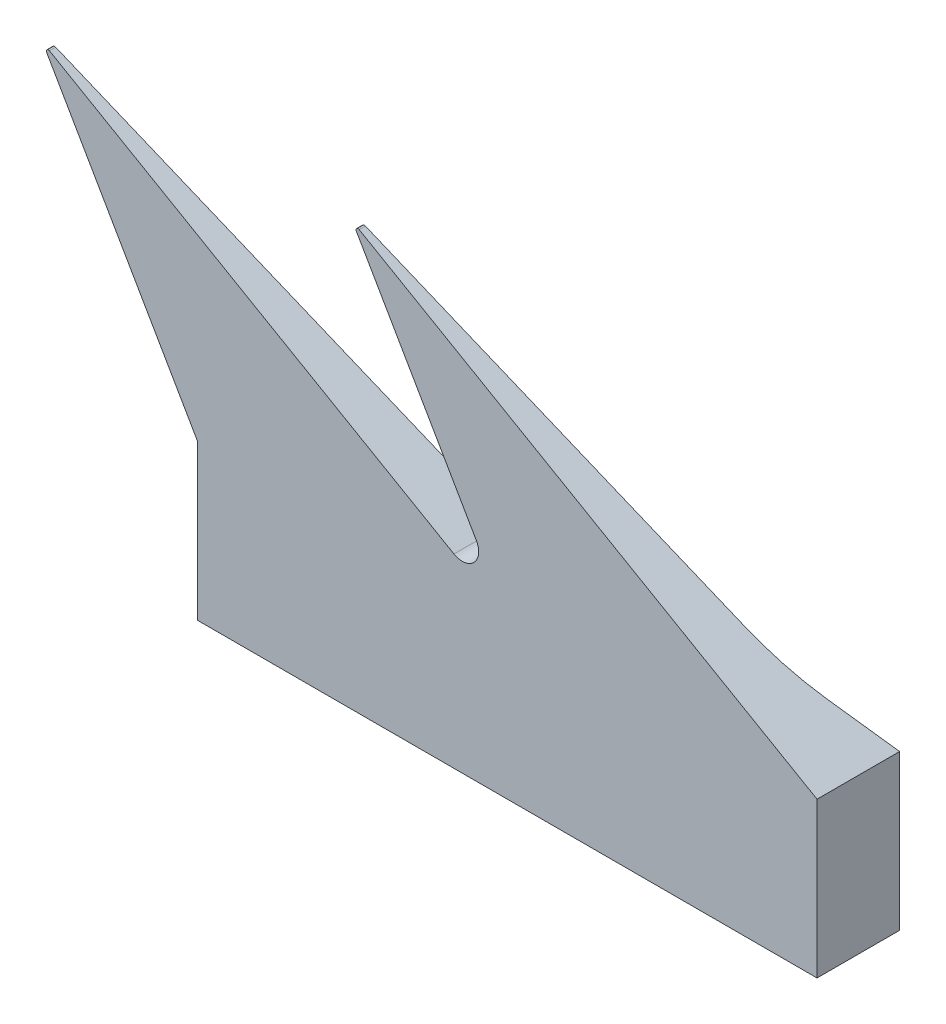
ISO-10303-21;
HEADER;
FILE_DESCRIPTION(('STEP AP214'),'2;1');
FILE_NAME('part.step','',(''),(''),'','','');
FILE_SCHEMA(('AUTOMOTIVE_DESIGN { 1 0 10303 214 1 1 1 1 }'));
ENDSEC;
DATA;
#1=APPLICATION_CONTEXT('core data for automotive mechanical design processes');
#2=APPLICATION_PROTOCOL_DEFINITION('international standard','automotive_design',2000,#1);
#3=PRODUCT_CONTEXT('',#1,'mechanical');
#4=PRODUCT('Part','Part','',(#3));
#5=PRODUCT_RELATED_PRODUCT_CATEGORY('part','',(#4));
#6=PRODUCT_DEFINITION_FORMATION('','',#4);
#7=PRODUCT_DEFINITION_CONTEXT('part definition',#1,'design');
#8=PRODUCT_DEFINITION('design','',#6,#7);
#9=PRODUCT_DEFINITION_SHAPE('','',#8);
#10=(LENGTH_UNIT() NAMED_UNIT(*) SI_UNIT(.MILLI.,.METRE.));
#11=(NAMED_UNIT(*) PLANE_ANGLE_UNIT() SI_UNIT($,.RADIAN.));
#12=(NAMED_UNIT(*) SI_UNIT($,.STERADIAN.) SOLID_ANGLE_UNIT());
#13=UNCERTAINTY_MEASURE_WITH_UNIT(LENGTH_MEASURE(1.E-05),#10,'distance_accuracy_value','');
#14=(GEOMETRIC_REPRESENTATION_CONTEXT(3) GLOBAL_UNCERTAINTY_ASSIGNED_CONTEXT((#13)) GLOBAL_UNIT_ASSIGNED_CONTEXT((#10,
#11,#12)) REPRESENTATION_CONTEXT('',''));
#15=CARTESIAN_POINT('',(0.,0.,0.));
#16=DIRECTION('',(0.,0.,1.));
#17=DIRECTION('',(1.,0.,0.));
#18=AXIS2_PLACEMENT_3D('',#15,#16,#17);
#19=CARTESIAN_POINT('',(1.5,0.,0.4));
#20=DIRECTION('',(1.,0.,0.));
#21=DIRECTION('',(0.,1.,0.));
#22=AXIS2_PLACEMENT_3D('',#19,#20,#21);
#23=PLANE('',#22);
#24=DIRECTION('',(0.,-1.,0.));
#25=VECTOR('',#24,1.);
#26=CARTESIAN_POINT('',(1.5,0.,0.));
#27=LINE('',#26,#25);
#28=CARTESIAN_POINT('',(1.5,0.0240896666818581,0.));
#29=VERTEX_POINT('',#28);
#30=CARTESIAN_POINT('',(1.49999999999998,-0.725910333317876,0.));
#31=VERTEX_POINT('',#30);
#32=EDGE_CURVE('E128',#29,#31,#27,.T.);
#33=ORIENTED_EDGE('',*,*,#32,.F.);
#34=DIRECTION('',(0.,0.,-1.));
#35=VECTOR('',#34,1.);
#36=CARTESIAN_POINT('',(1.5,0.0240896666818581,0.4));
#37=LINE('',#36,#35);
#38=CARTESIAN_POINT('',(1.5,0.0240896666818581,0.4));
#39=VERTEX_POINT('',#38);
#40=EDGE_CURVE('E76',#39,#29,#37,.T.);
#41=ORIENTED_EDGE('',*,*,#40,.F.);
#42=DIRECTION('',(0.,-1.,0.));
#43=VECTOR('',#42,1.);
#44=CARTESIAN_POINT('',(1.5,0.,0.4));
#45=LINE('',#44,#43);
#46=CARTESIAN_POINT('',(1.49999999999998,-0.725910333317876,0.4));
#47=VERTEX_POINT('',#46);
#48=EDGE_CURVE('E135',#39,#47,#45,.T.);
#49=ORIENTED_EDGE('',*,*,#48,.T.);
#50=DIRECTION('',(0.,0.,-1.));
#51=VECTOR('',#50,1.);
#52=CARTESIAN_POINT('',(1.49999999999998,-0.725910333317876,0.4));
#53=LINE('',#52,#51);
#54=EDGE_CURVE('E70',#47,#31,#53,.T.);
#55=ORIENTED_EDGE('',*,*,#54,.T.);
#56=EDGE_LOOP('',(#33,#41,#49,#55));
#57=FACE_BOUND('',#56,.T.);
#58=ADVANCED_FACE('F32',(#57),#23,.T.);
#59=CARTESIAN_POINT('',(0.385431131657719,0.667586302849791,0.4));
#60=DIRECTION('',(-0.500000000000083,-0.866025403784391,0.));
#61=DIRECTION('',(0.866025403784391,-0.500000000000083,0.));
#62=AXIS2_PLACEMENT_3D('',#59,#60,#61);
#63=PLANE('',#62);
#64=ORIENTED_EDGE('',*,*,#40,.T.);
#65=DIRECTION('',(-0.818098303736618,0.472329275886017,0.328055209628287));
#66=VECTOR('',#65,1.);
#67=CARTESIAN_POINT('',(0.398028714891227,0.660313084778785,0.441887508248759));
#68=LINE('',#67,#66);
#69=CARTESIAN_POINT('',(1.24899413568054,0.169007970014901,0.100652673475971));
#70=VERTEX_POINT('',#69);
#71=EDGE_CURVE('E177',#29,#70,#68,.T.);
#72=ORIENTED_EDGE('',*,*,#71,.T.);
#73=CARTESIAN_POINT('',(0.754967328739854,0.454234479989063,-0.310012443143357));
#74=DIRECTION('',(-0.500000000000083,-0.866025403784391,0.));
#75=DIRECTION('',(0.866025403784391,-0.500000000000083,0.));
#76=AXIS2_PLACEMENT_3D('',#73,#74,#75);
#77=ELLIPSE('',#76,0.999999999999878,0.5);
#78=CARTESIAN_POINT('',(0.92481566776194,0.356172495733229,0.180277111348485));
#79=VERTEX_POINT('',#78);
#80=EDGE_CURVE('E131',#70,#79,#77,.T.);
#81=ORIENTED_EDGE('',*,*,#80,.T.);
#82=DIRECTION('',(-0.861727130004754,0.497518390476358,0.0995078115103677));
#83=VECTOR('',#82,1.);
#84=CARTESIAN_POINT('',(0.371931086035538,0.675380557823831,0.244121375767914));
#85=LINE('',#84,#83);
#86=CARTESIAN_POINT('',(-0.717679491924285,1.30446751832094,0.369943994362655));
#87=VERTEX_POINT('',#86);
#88=EDGE_CURVE('E191',#79,#87,#85,.T.);
#89=ORIENTED_EDGE('',*,*,#88,.T.);
#90=DIRECTION('',(0.,0.,-1.));
#91=VECTOR('',#90,1.);
#92=CARTESIAN_POINT('',(-0.717679491924285,1.30446751832094,0.4));
#93=LINE('',#92,#91);
#94=CARTESIAN_POINT('',(-0.717679491924285,1.30446751832094,0.4));
#95=VERTEX_POINT('',#94);
#96=EDGE_CURVE('E151',#95,#87,#93,.T.);
#97=ORIENTED_EDGE('',*,*,#96,.F.);
#98=DIRECTION('',(-0.866025403784391,0.500000000000083,0.));
#99=VECTOR('',#98,1.);
#100=CARTESIAN_POINT('',(0.385431131657719,0.667586302849791,0.4));
#101=LINE('',#100,#99);
#102=EDGE_CURVE('E265',#39,#95,#101,.T.);
#103=ORIENTED_EDGE('',*,*,#102,.F.);
#104=EDGE_LOOP('',(#64,#72,#81,#89,#97,#103));
#105=FACE_BOUND('',#104,.T.);
#106=ADVANCED_FACE('F253',(#105),#63,.F.);
#107=CARTESIAN_POINT('',(-0.722679491924286,1.29580726428309,0.4));
#108=DIRECTION('',(0.,0.,-1.));
#109=DIRECTION('',(-1.,0.,0.));
#110=AXIS2_PLACEMENT_3D('',#107,#108,#109);
#111=CYLINDRICAL_SURFACE('',#110,0.00999999999999989);
#112=ORIENTED_EDGE('',*,*,#96,.T.);
#113=CARTESIAN_POINT('',(-0.722679491924286,1.29580726428309,0.368211871605134));
#114=DIRECTION('',(0.,-0.19612396851166,0.980579108983685));
#115=DIRECTION('',(0.,-0.980579108983685,-0.19612396851166));
#116=AXIS2_PLACEMENT_3D('',#113,#114,#115);
#117=ELLIPSE('',#116,0.0101980553209667,0.00999999999999989);
#118=CARTESIAN_POINT('',(-0.73133974596213,1.29080726428309,0.367211830064809));
#119=VERTEX_POINT('',#118);
#120=EDGE_CURVE('E188',#87,#119,#117,.T.);
#121=ORIENTED_EDGE('',*,*,#120,.T.);
#122=DIRECTION('',(0.,0.,-1.));
#123=VECTOR('',#122,1.);
#124=CARTESIAN_POINT('',(-0.73133974596213,1.29080726428309,0.4));
#125=LINE('',#124,#123);
#126=CARTESIAN_POINT('',(-0.73133974596213,1.29080726428309,0.4));
#127=VERTEX_POINT('',#126);
#128=EDGE_CURVE('E148',#127,#119,#125,.T.);
#129=ORIENTED_EDGE('',*,*,#128,.F.);
#130=CARTESIAN_POINT('',(-0.722679491924286,1.29580726428309,0.4));
#131=DIRECTION('',(0.,0.,1.));
#132=DIRECTION('',(1.,0.,0.));
#133=AXIS2_PLACEMENT_3D('',#130,#131,#132);
#134=CIRCLE('',#133,0.00999999999999989);
#135=EDGE_CURVE('E267',#95,#127,#134,.T.);
#136=ORIENTED_EDGE('',*,*,#135,.F.);
#137=EDGE_LOOP('',(#112,#121,#129,#136));
#138=FACE_BOUND('',#137,.T.);
#139=ADVANCED_FACE('F257',(#138),#111,.T.);
#140=CARTESIAN_POINT('',(0.010431131657716,0.00602241667053465,0.4));
#141=DIRECTION('',(-0.866025403784444,-0.499999999999991,0.));
#142=DIRECTION('',(0.499999999999991,-0.866025403784444,0.));
#143=AXIS2_PLACEMENT_3D('',#140,#141,#142);
#144=PLANE('',#143);
#145=CARTESIAN_POINT('',(-0.248344223753283,0.454234479989088,-0.310012443143357));
#146=DIRECTION('',(-0.866025403784444,-0.499999999999991,0.));
#147=DIRECTION('',(0.499999999999991,-0.866025403784444,0.));
#148=AXIS2_PLACEMENT_3D('',#145,#146,#147);
#149=ELLIPSE('',#148,0.577350269189631,0.5);
#150=CARTESIAN_POINT('',(-0.149282032302751,0.282653731287654,0.15962576513516));
#151=VERTEX_POINT('',#150);
#152=CARTESIAN_POINT('',(-0.19172811074591,0.356172495733256,0.180277111348485));
#153=VERTEX_POINT('',#152);
#154=EDGE_CURVE('E322',#151,#153,#149,.T.);
#155=ORIENTED_EDGE('',*,*,#154,.F.);
#156=DIRECTION('',(0.,0.,-1.));
#157=VECTOR('',#156,1.);
#158=CARTESIAN_POINT('',(-0.149282032302753,0.282653731287652,0.4));
#159=LINE('',#158,#157);
#160=CARTESIAN_POINT('',(-0.149282032302753,0.282653731287652,0.4));
#161=VERTEX_POINT('',#160);
#162=EDGE_CURVE('E145',#161,#151,#159,.T.);
#163=ORIENTED_EDGE('',*,*,#162,.F.);
#164=DIRECTION('',(-0.499999999999991,0.866025403784444,0.));
#165=VECTOR('',#164,1.);
#166=CARTESIAN_POINT('',(0.010431131657716,0.00602241667053465,0.4));
#167=LINE('',#166,#165);
#168=EDGE_CURVE('E273',#161,#127,#167,.T.);
#169=ORIENTED_EDGE('',*,*,#168,.T.);
#170=ORIENTED_EDGE('',*,*,#128,.T.);
#171=DIRECTION('',(-0.492664042989798,0.853319153520647,0.170670920135075));
#172=VECTOR('',#171,1.);
#173=CARTESIAN_POINT('',(-0.0139325297127397,0.0482215160225681,0.118684356929609));
#174=LINE('',#173,#172);
#175=EDGE_CURVE('E179',#153,#119,#174,.T.);
#176=ORIENTED_EDGE('',*,*,#175,.F.);
#177=EDGE_LOOP('',(#155,#163,#169,#170,#176));
#178=FACE_BOUND('',#177,.T.);
#179=ADVANCED_FACE('F249',(#178),#144,.T.);
#180=CARTESIAN_POINT('',(-0.218564064605506,0.242653731287658,0.4));
#181=DIRECTION('',(0.,0.,-1.));
#182=DIRECTION('',(-1.,0.,0.));
#183=AXIS2_PLACEMENT_3D('',#180,#181,#182);
#184=CYLINDRICAL_SURFACE('',#183,0.0799999999999975);
#185=ORIENTED_EDGE('',*,*,#162,.T.);
#186=CARTESIAN_POINT('',(-0.149282032302751,0.282653731287654,0.15962576513516));
#187=CARTESIAN_POINT('',(-0.146884837215577,0.278508743182085,0.158114360044012));
#188=CARTESIAN_POINT('',(-0.144890862550081,0.274189483281882,0.156471407046757));
#189=CARTESIAN_POINT('',(-0.141714361453526,0.265366084277465,0.152967485018155));
#190=CARTESIAN_POINT('',(-0.14052871405971,0.260862728231349,0.151107387365389));
#191=CARTESIAN_POINT('',(-0.13895655981659,0.251807665474613,0.147205079564808));
#192=CARTESIAN_POINT('',(-0.138568763684309,0.247256048735563,0.145163168797352));
#193=CARTESIAN_POINT('',(-0.138559447627537,0.238213658417276,0.140941975359255));
#194=CARTESIAN_POINT('',(-0.138938557814552,0.233722937923936,0.138762581153763));
#195=CARTESIAN_POINT('',(-0.140483293413687,0.224587569033454,0.134161296285397));
#196=CARTESIAN_POINT('',(-0.141703843429069,0.219955293907089,0.131733269558733));
#197=CARTESIAN_POINT('',(-0.144944566699345,0.210984400758366,0.126857687891191));
#198=CARTESIAN_POINT('',(-0.146965589070058,0.206646100316522,0.124410114926487));
#199=CARTESIAN_POINT('',(-0.1519044791991,0.198133211578873,0.119449719349291));
#200=CARTESIAN_POINT('',(-0.154866583942777,0.193981738426713,0.116941028718865));
#201=CARTESIAN_POINT('',(-0.161593441584595,0.186258083332911,0.112135950363567));
#202=CARTESIAN_POINT('',(-0.165356008037091,0.182684369132558,0.109839008267183));
#203=CARTESIAN_POINT('',(-0.172164234306231,0.177396494657992,0.106361129841321));
#204=CARTESIAN_POINT('',(-0.174992788311869,0.175471682874241,0.105072808978771));
#205=CARTESIAN_POINT('',(-0.180942899608193,0.171967046473847,0.102697617838169));
#206=CARTESIAN_POINT('',(-0.184065126535535,0.170388039030234,0.101611225635789));
#207=CARTESIAN_POINT('',(-0.18731823533885,0.169007970014937,0.100652673475971));
#208=B_SPLINE_CURVE_WITH_KNOTS('',3,(#186,#187,#188,#189,#190,#191,#192,#193,#194,#195,#196,
#197,#198,#199,#200,#201,#202,#203,#204,#205,#206,#207),.UNSPECIFIED.,.F.,.F.,(4,2,2,2,2,2,2,2,
2,2,4),(0.,0.0150302016528783,0.0300020377510201,0.0449496611368871,0.0599095708929511,
0.0759519259641572,0.0920113440320434,0.108978523568586,0.125899939351582,0.13683655717655,
0.147798747024277),.UNSPECIFIED.);
#209=CARTESIAN_POINT('',(-0.18731823533885,0.169007970014937,0.100652673475971));
#210=VERTEX_POINT('',#209);
#211=EDGE_CURVE('E206',#151,#210,#208,.T.);
#212=ORIENTED_EDGE('',*,*,#211,.T.);
#213=CARTESIAN_POINT('',(-0.218564064605506,0.242653731287658,0.151803167180258));
#214=DIRECTION('',(0.,-0.570453019948295,0.821330233238659));
#215=DIRECTION('',(0.,-0.821330233238659,-0.570453019948295));
#216=AXIS2_PLACEMENT_3D('',#213,#214,#215);
#217=ELLIPSE('',#216,0.0974029650467662,0.0799999999999975);
#218=CARTESIAN_POINT('',(-0.249809893872165,0.169007970014939,0.100652673475971));
#219=VERTEX_POINT('',#218);
#220=EDGE_CURVE('E182',#210,#219,#217,.F.);
#221=ORIENTED_EDGE('',*,*,#220,.T.);
#222=CARTESIAN_POINT('',(-0.249809893872165,0.169007970014939,0.100652673475971));
#223=CARTESIAN_POINT('',(-0.251327377319013,0.169652934740277,0.101101238177096));
#224=CARTESIAN_POINT('',(-0.252815633271123,0.170339061184294,0.101575245499588));
#225=CARTESIAN_POINT('',(-0.255733690182096,0.171793637507805,0.102574145386014));
#226=CARTESIAN_POINT('',(-0.25716349114111,0.172562087387086,0.103099037949817));
#227=CARTESIAN_POINT('',(-0.258564064605537,0.173371698984833,0.103649373134855));
#228=B_SPLINE_CURVE_WITH_KNOTS('',3,(#222,#223,#224,#225,#226,#227),.UNSPECIFIED.,.F.,.F.,(4,2,
4),(0.,0.00511793160969459,0.0102358632061603),.UNSPECIFIED.);
#229=CARTESIAN_POINT('',(-0.258564064605506,0.173371698984903,0.103649373134862));
#230=VERTEX_POINT('',#229);
#231=EDGE_CURVE('E197',#219,#230,#228,.T.);
#232=ORIENTED_EDGE('',*,*,#231,.T.);
#233=DIRECTION('',(0.,0.,-1.));
#234=VECTOR('',#233,1.);
#235=CARTESIAN_POINT('',(-0.258564064605506,0.173371698984903,0.4));
#236=LINE('',#235,#234);
#237=CARTESIAN_POINT('',(-0.258564064605506,0.173371698984903,0.4));
#238=VERTEX_POINT('',#237);
#239=EDGE_CURVE('E142',#238,#230,#236,.T.);
#240=ORIENTED_EDGE('',*,*,#239,.F.);
#241=CARTESIAN_POINT('',(-0.218564064605506,0.242653731287658,0.4));
#242=DIRECTION('',(0.,0.,1.));
#243=DIRECTION('',(1.,0.,0.));
#244=AXIS2_PLACEMENT_3D('',#241,#242,#243);
#245=CIRCLE('',#244,0.0799999999999975);
#246=EDGE_CURVE('E276',#161,#238,#245,.F.);
#247=ORIENTED_EDGE('',*,*,#246,.F.);
#248=EDGE_LOOP('',(#185,#212,#221,#232,#240,#247));
#249=FACE_BOUND('',#248,.T.);
#250=ADVANCED_FACE('F212',(#249),#184,.F.);
#251=CARTESIAN_POINT('',(0.0104311316577212,0.0180672500116134,0.4));
#252=DIRECTION('',(0.499999999999998,0.86602540378444,0.));
#253=DIRECTION('',(-0.86602540378444,0.499999999999998,0.));
#254=AXIS2_PLACEMENT_3D('',#251,#252,#253);
#255=PLANE('',#254);
#256=CARTESIAN_POINT('',(-0.74503267125987,0.454234479989101,-0.310012443143357));
#257=DIRECTION('',(0.499999999999998,0.86602540378444,0.));
#258=DIRECTION('',(0.86602540378444,-0.499999999999998,0.));
#259=AXIS2_PLACEMENT_3D('',#256,#257,#258);
#260=ELLIPSE('',#259,1.00000000000005,0.5);
#261=CARTESIAN_POINT('',(-0.575184332237743,0.356172495733266,0.180277111348485));
#262=VERTEX_POINT('',#261);
#263=EDGE_CURVE('E194',#262,#230,#260,.T.);
#264=ORIENTED_EDGE('',*,*,#263,.F.);
#265=DIRECTION('',(0.861727130004805,-0.497518390476275,-0.0995078115103509));
#266=VECTOR('',#265,1.);
#267=CARTESIAN_POINT('',(-0.0142084440849831,0.0322929156993819,0.115498504529125));
#268=LINE('',#267,#266);
#269=CARTESIAN_POINT('',(-2.21767949192429,1.30446751832094,0.369943994362649));
#270=VERTEX_POINT('',#269);
#271=EDGE_CURVE('E176',#270,#262,#268,.T.);
#272=ORIENTED_EDGE('',*,*,#271,.F.);
#273=DIRECTION('',(0.,0.,-1.));
#274=VECTOR('',#273,1.);
#275=CARTESIAN_POINT('',(-2.21767949192429,1.30446751832094,0.4));
#276=LINE('',#275,#274);
#277=CARTESIAN_POINT('',(-2.21767949192429,1.30446751832094,0.4));
#278=VERTEX_POINT('',#277);
#279=EDGE_CURVE('E139',#278,#270,#276,.T.);
#280=ORIENTED_EDGE('',*,*,#279,.F.);
#281=DIRECTION('',(0.86602540378444,-0.499999999999998,0.));
#282=VECTOR('',#281,1.);
#283=CARTESIAN_POINT('',(0.0104311316577212,0.0180672500116134,0.4));
#284=LINE('',#283,#282);
#285=EDGE_CURVE('E123',#278,#238,#284,.T.);
#286=ORIENTED_EDGE('',*,*,#285,.T.);
#287=ORIENTED_EDGE('',*,*,#239,.T.);
#288=EDGE_LOOP('',(#264,#272,#280,#286,#287));
#289=FACE_BOUND('',#288,.T.);
#290=ADVANCED_FACE('F243',(#289),#255,.T.);
#291=CARTESIAN_POINT('',(-2.22267949192429,1.2958072642831,0.4));
#292=DIRECTION('',(0.,0.,-1.));
#293=DIRECTION('',(-1.,0.,0.));
#294=AXIS2_PLACEMENT_3D('',#291,#292,#293);
#295=CYLINDRICAL_SURFACE('',#294,0.00999999999999997);
#296=ORIENTED_EDGE('',*,*,#279,.T.);
#297=CARTESIAN_POINT('',(-2.22267949192429,1.2958072642831,0.368211871605127));
#298=DIRECTION('',(0.,-0.19612396851166,0.980579108983685));
#299=DIRECTION('',(0.,-0.980579108983685,-0.19612396851166));
#300=AXIS2_PLACEMENT_3D('',#297,#298,#299);
#301=ELLIPSE('',#300,0.0101980553209668,0.00999999999999997);
#302=CARTESIAN_POINT('',(-2.23133974596213,1.2908072642831,0.367211830064802));
#303=VERTEX_POINT('',#302);
#304=EDGE_CURVE('E167',#270,#303,#301,.T.);
#305=ORIENTED_EDGE('',*,*,#304,.T.);
#306=DIRECTION('',(0.,0.,-1.));
#307=VECTOR('',#306,1.);
#308=CARTESIAN_POINT('',(-2.23133974596213,1.2908072642831,0.4));
#309=LINE('',#308,#307);
#310=CARTESIAN_POINT('',(-2.23133974596213,1.2908072642831,0.4));
#311=VERTEX_POINT('',#310);
#312=EDGE_CURVE('E111',#311,#303,#309,.T.);
#313=ORIENTED_EDGE('',*,*,#312,.F.);
#314=CARTESIAN_POINT('',(-2.22267949192429,1.2958072642831,0.4));
#315=DIRECTION('',(0.,0.,1.));
#316=DIRECTION('',(1.,0.,0.));
#317=AXIS2_PLACEMENT_3D('',#314,#315,#316);
#318=CIRCLE('',#317,0.00999999999999997);
#319=EDGE_CURVE('E120',#278,#311,#318,.T.);
#320=ORIENTED_EDGE('',*,*,#319,.F.);
#321=EDGE_LOOP('',(#296,#305,#313,#320));
#322=FACE_BOUND('',#321,.T.);
#323=ADVANCED_FACE('F175',(#322),#295,.T.);
#324=CARTESIAN_POINT('',(-1.11456886834229,-0.643496636167787,0.4));
#325=DIRECTION('',(-0.866025403784443,-0.499999999999993,0.));
#326=DIRECTION('',(0.499999999999993,-0.866025403784443,0.));
#327=AXIS2_PLACEMENT_3D('',#324,#325,#326);
#328=PLANE('',#327);
#329=DIRECTION('',(-0.428463427866293,0.742120426249557,0.515438031119398));
#330=VECTOR('',#329,1.);
#331=CARTESIAN_POINT('',(-1.30530734821071,-0.313127898077222,-0.234213682160377));
#332=LINE('',#331,#330);
#333=CARTESIAN_POINT('',(-1.5,0.0240896666819335,0.));
#334=VERTEX_POINT('',#333);
#335=CARTESIAN_POINT('',(-1.58366862143971,0.169007970014972,0.100652673475971));
#336=VERTEX_POINT('',#335);
#337=EDGE_CURVE('E110',#334,#336,#332,.T.);
#338=ORIENTED_EDGE('',*,*,#337,.F.);
#339=DIRECTION('',(0.,0.,-1.));
#340=VECTOR('',#339,1.);
#341=CARTESIAN_POINT('',(-1.5,0.0240896666821488,0.4));
#342=LINE('',#341,#340);
#343=CARTESIAN_POINT('',(-1.5,0.0240896666821488,0.4));
#344=VERTEX_POINT('',#343);
#345=EDGE_CURVE('E101',#344,#334,#342,.T.);
#346=ORIENTED_EDGE('',*,*,#345,.F.);
#347=DIRECTION('',(-0.499999999999993,0.866025403784443,0.));
#348=VECTOR('',#347,1.);
#349=CARTESIAN_POINT('',(-1.11456886834229,-0.643496636167787,0.4));
#350=LINE('',#349,#348);
#351=EDGE_CURVE('E106',#344,#311,#350,.T.);
#352=ORIENTED_EDGE('',*,*,#351,.T.);
#353=ORIENTED_EDGE('',*,*,#312,.T.);
#354=DIRECTION('',(-0.492664042989799,0.853319153520646,0.170670920135075));
#355=VECTOR('',#354,1.);
#356=CARTESIAN_POINT('',(-1.14985574083016,-0.582377980178602,-0.0074407813722011));
#357=LINE('',#356,#355);
#358=CARTESIAN_POINT('',(-1.69172811074593,0.356172495733295,0.180277111348485));
#359=VERTEX_POINT('',#358);
#360=EDGE_CURVE('E40',#359,#303,#357,.T.);
#361=ORIENTED_EDGE('',*,*,#360,.F.);
#362=CARTESIAN_POINT('',(-1.7483442237533,0.454234479989126,-0.310012443143357));
#363=DIRECTION('',(-0.866025403784443,-0.499999999999993,0.));
#364=DIRECTION('',(0.499999999999993,-0.866025403784443,0.));
#365=AXIS2_PLACEMENT_3D('',#362,#363,#364);
#366=ELLIPSE('',#365,0.577350269189631,0.5);
#367=EDGE_CURVE('E11',#336,#359,#366,.T.);
#368=ORIENTED_EDGE('',*,*,#367,.F.);
#369=EDGE_LOOP('',(#338,#346,#352,#353,#361,#368));
#370=FACE_BOUND('',#369,.T.);
#371=ADVANCED_FACE('F103',(#370),#328,.T.);
#372=CARTESIAN_POINT('',(-1.5,0.,0.4));
#373=DIRECTION('',(1.,0.,0.));
#374=DIRECTION('',(0.,1.,0.));
#375=AXIS2_PLACEMENT_3D('',#372,#373,#374);
#376=PLANE('',#375);
#377=DIRECTION('',(0.,-1.,0.));
#378=VECTOR('',#377,1.);
#379=CARTESIAN_POINT('',(-1.5,0.,0.));
#380=LINE('',#379,#378);
#381=CARTESIAN_POINT('',(-1.50000000000001,-0.725910333317851,0.));
#382=VERTEX_POINT('',#381);
#383=EDGE_CURVE('E63',#334,#382,#380,.T.);
#384=ORIENTED_EDGE('',*,*,#383,.T.);
#385=DIRECTION('',(0.,0.,-1.));
#386=VECTOR('',#385,1.);
#387=CARTESIAN_POINT('',(-1.50000000000001,-0.725910333317851,0.4));
#388=LINE('',#387,#386);
#389=CARTESIAN_POINT('',(-1.50000000000001,-0.725910333317851,0.4));
#390=VERTEX_POINT('',#389);
#391=EDGE_CURVE('E112',#390,#382,#388,.T.);
#392=ORIENTED_EDGE('',*,*,#391,.F.);
#393=DIRECTION('',(0.,-1.,0.));
#394=VECTOR('',#393,1.);
#395=CARTESIAN_POINT('',(-1.5,0.,0.4));
#396=LINE('',#395,#394);
#397=EDGE_CURVE('E114',#344,#390,#396,.T.);
#398=ORIENTED_EDGE('',*,*,#397,.F.);
#399=ORIENTED_EDGE('',*,*,#345,.T.);
#400=EDGE_LOOP('',(#384,#392,#398,#399));
#401=FACE_BOUND('',#400,.T.);
#402=ADVANCED_FACE('F115',(#401),#376,.F.);
#403=CARTESIAN_POINT('',(0.,-0.725910333317864,0.4));
#404=DIRECTION('',(0.,1.,0.));
#405=DIRECTION('',(-1.,0.,0.));
#406=AXIS2_PLACEMENT_3D('',#403,#404,#405);
#407=PLANE('',#406);
#408=DIRECTION('',(1.,0.,0.));
#409=VECTOR('',#408,1.);
#410=CARTESIAN_POINT('',(0.,-0.725910333317864,0.));
#411=LINE('',#410,#409);
#412=EDGE_CURVE('E133',#382,#31,#411,.T.);
#413=ORIENTED_EDGE('',*,*,#412,.T.);
#414=ORIENTED_EDGE('',*,*,#54,.F.);
#415=DIRECTION('',(1.,0.,0.));
#416=VECTOR('',#415,1.);
#417=CARTESIAN_POINT('',(0.,-0.725910333317864,0.4));
#418=LINE('',#417,#416);
#419=EDGE_CURVE('E48',#390,#47,#418,.T.);
#420=ORIENTED_EDGE('',*,*,#419,.F.);
#421=ORIENTED_EDGE('',*,*,#391,.T.);
#422=EDGE_LOOP('',(#413,#414,#420,#421));
#423=FACE_BOUND('',#422,.T.);
#424=ADVANCED_FACE('F231',(#423),#407,.F.);
#425=CARTESIAN_POINT('',(0.,0.,0.4));
#426=DIRECTION('',(0.,0.,1.));
#427=DIRECTION('',(1.,0.,0.));
#428=AXIS2_PLACEMENT_3D('',#425,#426,#427);
#429=PLANE('',#428);
#430=ORIENTED_EDGE('',*,*,#48,.F.);
#431=ORIENTED_EDGE('',*,*,#102,.T.);
#432=ORIENTED_EDGE('',*,*,#135,.T.);
#433=ORIENTED_EDGE('',*,*,#168,.F.);
#434=ORIENTED_EDGE('',*,*,#246,.T.);
#435=ORIENTED_EDGE('',*,*,#285,.F.);
#436=ORIENTED_EDGE('',*,*,#319,.T.);
#437=ORIENTED_EDGE('',*,*,#351,.F.);
#438=ORIENTED_EDGE('',*,*,#397,.T.);
#439=ORIENTED_EDGE('',*,*,#419,.T.);
#440=EDGE_LOOP('',(#430,#431,#432,#433,#434,#435,#436,#437,#438,#439));
#441=FACE_BOUND('',#440,.T.);
#442=ADVANCED_FACE('F117',(#441),#429,.T.);
#443=CARTESIAN_POINT('',(0.,0.,0.));
#444=DIRECTION('',(0.,0.,1.));
#445=DIRECTION('',(1.,0.,0.));
#446=AXIS2_PLACEMENT_3D('',#443,#444,#445);
#447=PLANE('',#446);
#448=ORIENTED_EDGE('',*,*,#383,.F.);
#449=DIRECTION('',(1.,0.,0.));
#450=VECTOR('',#449,1.);
#451=CARTESIAN_POINT('',(0.,0.0240896666818958,0.));
#452=LINE('',#451,#450);
#453=EDGE_CURVE('E155',#334,#29,#452,.T.);
#454=ORIENTED_EDGE('',*,*,#453,.T.);
#455=ORIENTED_EDGE('',*,*,#32,.T.);
#456=ORIENTED_EDGE('',*,*,#412,.F.);
#457=EDGE_LOOP('',(#448,#454,#455,#456));
#458=FACE_BOUND('',#457,.T.);
#459=ADVANCED_FACE('F222',(#458),#447,.F.);
#460=CARTESIAN_POINT('',(-5.89999999999999,0.45423447998923,-0.310012443143357));
#461=DIRECTION('',(1.,0.,0.));
#462=DIRECTION('',(0.,1.,0.));
#463=AXIS2_PLACEMENT_3D('',#460,#461,#462);
#464=CYLINDRICAL_SURFACE('',#463,0.5);
#465=DIRECTION('',(1.,0.,0.));
#466=VECTOR('',#465,1.);
#467=CARTESIAN_POINT('',(-5.9,0.169007970015081,0.100652673475971));
#468=LINE('',#467,#466);
#469=EDGE_CURVE('E297',#210,#70,#468,.T.);
#470=ORIENTED_EDGE('',*,*,#469,.F.);
#471=ORIENTED_EDGE('',*,*,#211,.F.);
#472=ORIENTED_EDGE('',*,*,#154,.T.);
#473=DIRECTION('',(1.,0.,0.));
#474=VECTOR('',#473,1.);
#475=CARTESIAN_POINT('',(-5.9,0.3561724957334,0.180277111348485));
#476=LINE('',#475,#474);
#477=EDGE_CURVE('E301',#153,#79,#476,.T.);
#478=ORIENTED_EDGE('',*,*,#477,.T.);
#479=ORIENTED_EDGE('',*,*,#80,.F.);
#480=EDGE_LOOP('',(#470,#471,#472,#478,#479));
#481=FACE_BOUND('',#480,.T.);
#482=ADVANCED_FACE('F216',(#481),#464,.F.);
#483=EDGE_CURVE('E292',#336,#219,#468,.T.);
#484=ORIENTED_EDGE('',*,*,#483,.F.);
#485=ORIENTED_EDGE('',*,*,#367,.T.);
#486=EDGE_CURVE('E171',#359,#262,#476,.T.);
#487=ORIENTED_EDGE('',*,*,#486,.T.);
#488=ORIENTED_EDGE('',*,*,#263,.T.);
#489=ORIENTED_EDGE('',*,*,#231,.F.);
#490=EDGE_LOOP('',(#484,#485,#487,#488,#489));
#491=FACE_BOUND('',#490,.T.);
#492=ADVANCED_FACE('F221',(#491),#464,.F.);
#493=CARTESIAN_POINT('',(-5.89999999999997,1.43211768832239,0.395475088888823));
#494=DIRECTION('',(0.,-0.19612396851166,0.980579108983685));
#495=DIRECTION('',(0.,-0.980579108983685,-0.19612396851166));
#496=AXIS2_PLACEMENT_3D('',#493,#494,#495);
#497=PLANE('',#496);
#498=ORIENTED_EDGE('',*,*,#477,.F.);
#499=ORIENTED_EDGE('',*,*,#175,.T.);
#500=ORIENTED_EDGE('',*,*,#120,.F.);
#501=ORIENTED_EDGE('',*,*,#88,.F.);
#502=EDGE_LOOP('',(#498,#499,#500,#501));
#503=FACE_BOUND('',#502,.T.);
#504=ADVANCED_FACE('F228',(#503),#497,.F.);
#505=CARTESIAN_POINT('',(-5.9,0.169007970015081,0.100652673475971));
#506=DIRECTION('',(0.,-0.570453019948295,0.821330233238659));
#507=DIRECTION('',(0.,-0.821330233238659,-0.570453019948295));
#508=AXIS2_PLACEMENT_3D('',#505,#506,#507);
#509=PLANE('',#508);
#510=ORIENTED_EDGE('',*,*,#453,.F.);
#511=ORIENTED_EDGE('',*,*,#337,.T.);
#512=ORIENTED_EDGE('',*,*,#483,.T.);
#513=ORIENTED_EDGE('',*,*,#220,.F.);
#514=ORIENTED_EDGE('',*,*,#469,.T.);
#515=ORIENTED_EDGE('',*,*,#71,.F.);
#516=EDGE_LOOP('',(#510,#511,#512,#513,#514,#515));
#517=FACE_BOUND('',#516,.T.);
#518=ADVANCED_FACE('F224',(#517),#509,.F.);
#519=ORIENTED_EDGE('',*,*,#271,.T.);
#520=ORIENTED_EDGE('',*,*,#486,.F.);
#521=ORIENTED_EDGE('',*,*,#360,.T.);
#522=ORIENTED_EDGE('',*,*,#304,.F.);
#523=EDGE_LOOP('',(#519,#520,#521,#522));
#524=FACE_BOUND('',#523,.T.);
#525=ADVANCED_FACE('F165',(#524),#497,.F.);
#526=CLOSED_SHELL('',(#58,#106,#139,#179,#250,#290,#323,#371,#402,#424,#442,#459,#482,#492,#504,
#518,#525));
#527=MANIFOLD_SOLID_BREP('B2',#526);
#528=ADVANCED_BREP_SHAPE_REPRESENTATION('',(#18,#527),#14);
#529=SHAPE_DEFINITION_REPRESENTATION(#9,#528);
ENDSEC;
END-ISO-10303-21;
